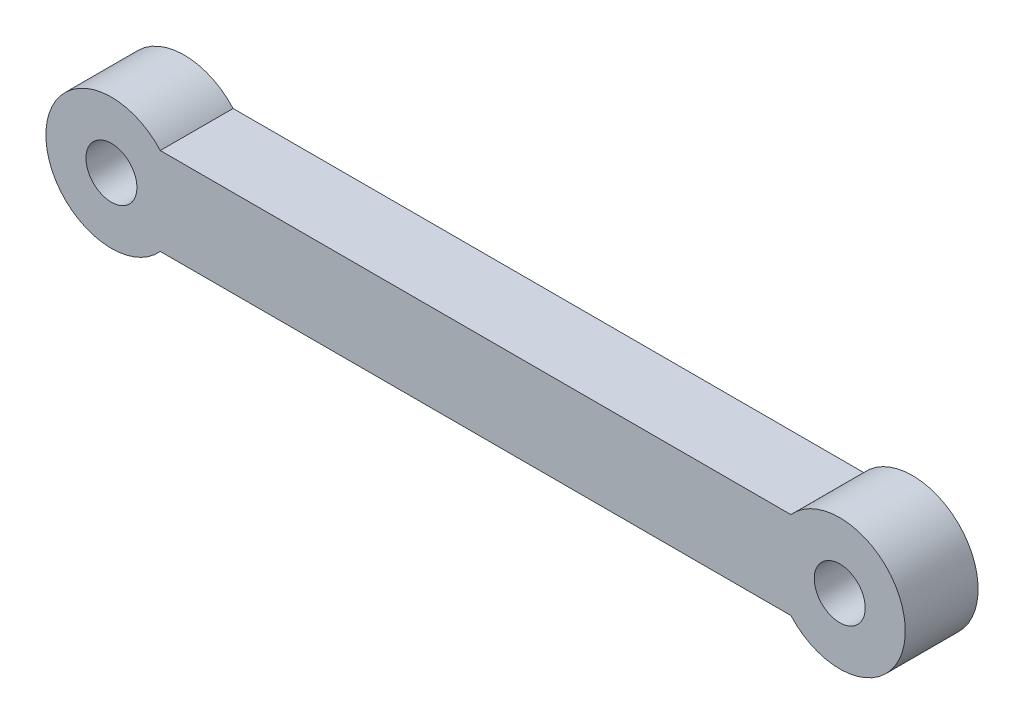
ISO-10303-21;
HEADER;
FILE_DESCRIPTION(('STEP AP214'),'2;1');
FILE_NAME('part.step','',(''),(''),'','','');
FILE_SCHEMA(('AUTOMOTIVE_DESIGN { 1 0 10303 214 1 1 1 1 }'));
ENDSEC;
DATA;
#1=APPLICATION_CONTEXT('core data for automotive mechanical design processes');
#2=APPLICATION_PROTOCOL_DEFINITION('international standard','automotive_design',2000,#1);
#3=PRODUCT_CONTEXT('',#1,'mechanical');
#4=PRODUCT('Part','Part','',(#3));
#5=PRODUCT_RELATED_PRODUCT_CATEGORY('part','',(#4));
#6=PRODUCT_DEFINITION_FORMATION('','',#4);
#7=PRODUCT_DEFINITION_CONTEXT('part definition',#1,'design');
#8=PRODUCT_DEFINITION('design','',#6,#7);
#9=PRODUCT_DEFINITION_SHAPE('','',#8);
#10=(LENGTH_UNIT() NAMED_UNIT(*) SI_UNIT(.MILLI.,.METRE.));
#11=(NAMED_UNIT(*) PLANE_ANGLE_UNIT() SI_UNIT($,.RADIAN.));
#12=(NAMED_UNIT(*) SI_UNIT($,.STERADIAN.) SOLID_ANGLE_UNIT());
#13=UNCERTAINTY_MEASURE_WITH_UNIT(LENGTH_MEASURE(1.E-05),#10,'distance_accuracy_value','');
#14=(GEOMETRIC_REPRESENTATION_CONTEXT(3) GLOBAL_UNCERTAINTY_ASSIGNED_CONTEXT((#13)) GLOBAL_UNIT_ASSIGNED_CONTEXT((#10,
#11,#12)) REPRESENTATION_CONTEXT('',''));
#15=CARTESIAN_POINT('',(0.,0.,0.));
#16=DIRECTION('',(0.,0.,1.));
#17=DIRECTION('',(1.,0.,0.));
#18=AXIS2_PLACEMENT_3D('',#15,#16,#17);
#19=CARTESIAN_POINT('',(-50.,0.,5.));
#20=DIRECTION('',(0.,0.,1.));
#21=DIRECTION('',(1.,0.,0.));
#22=AXIS2_PLACEMENT_3D('',#19,#20,#21);
#23=PLANE('',#22);
#24=CARTESIAN_POINT('',(0.,0.,5.));
#25=DIRECTION('',(0.,0.,1.));
#26=DIRECTION('',(1.,0.,0.));
#27=AXIS2_PLACEMENT_3D('',#24,#25,#26);
#28=CIRCLE('',#27,1.75);
#29=CARTESIAN_POINT('',(1.75,0.,5.));
#30=VERTEX_POINT('',#29);
#31=EDGE_CURVE('E100',#30,#30,#28,.T.);
#32=ORIENTED_EDGE('',*,*,#31,.F.);
#33=EDGE_LOOP('',(#32));
#34=FACE_BOUND('',#33,.T.);
#35=CARTESIAN_POINT('',(-50.,0.,5.));
#36=DIRECTION('',(0.,0.,1.));
#37=DIRECTION('',(1.,0.,0.));
#38=AXIS2_PLACEMENT_3D('',#35,#36,#37);
#39=CIRCLE('',#38,4.50000000000001);
#40=CARTESIAN_POINT('',(-46.6458980337503,3.,5.));
#41=VERTEX_POINT('',#40);
#42=CARTESIAN_POINT('',(-46.6458980337503,-3.,5.));
#43=VERTEX_POINT('',#42);
#44=EDGE_CURVE('E85',#41,#43,#39,.T.);
#45=ORIENTED_EDGE('',*,*,#44,.T.);
#46=DIRECTION('',(1.,0.,0.));
#47=VECTOR('',#46,1.);
#48=CARTESIAN_POINT('',(-3.35410196624968,-3.,5.));
#49=LINE('',#48,#47);
#50=CARTESIAN_POINT('',(-3.35410196624968,-3.,5.));
#51=VERTEX_POINT('',#50);
#52=EDGE_CURVE('E80',#43,#51,#49,.T.);
#53=ORIENTED_EDGE('',*,*,#52,.T.);
#54=CARTESIAN_POINT('',(0.,0.,5.));
#55=DIRECTION('',(0.,0.,1.));
#56=DIRECTION('',(1.,0.,0.));
#57=AXIS2_PLACEMENT_3D('',#54,#55,#56);
#58=CIRCLE('',#57,4.5);
#59=CARTESIAN_POINT('',(-3.35410196624968,3.,5.));
#60=VERTEX_POINT('',#59);
#61=EDGE_CURVE('E83',#51,#60,#58,.T.);
#62=ORIENTED_EDGE('',*,*,#61,.T.);
#63=DIRECTION('',(-1.,0.,0.));
#64=VECTOR('',#63,1.);
#65=CARTESIAN_POINT('',(-3.35410196624968,3.,5.));
#66=LINE('',#65,#64);
#67=EDGE_CURVE('E50',#60,#41,#66,.T.);
#68=ORIENTED_EDGE('',*,*,#67,.T.);
#69=EDGE_LOOP('',(#45,#53,#62,#68));
#70=FACE_BOUND('',#69,.T.);
#71=CARTESIAN_POINT('',(-50.,0.,5.));
#72=DIRECTION('',(0.,0.,1.));
#73=DIRECTION('',(1.,0.,0.));
#74=AXIS2_PLACEMENT_3D('',#71,#72,#73);
#75=CIRCLE('',#74,1.75);
#76=CARTESIAN_POINT('',(-48.25,0.,5.));
#77=VERTEX_POINT('',#76);
#78=EDGE_CURVE('E115',#77,#77,#75,.T.);
#79=ORIENTED_EDGE('',*,*,#78,.F.);
#80=EDGE_LOOP('',(#79));
#81=FACE_BOUND('',#80,.T.);
#82=ADVANCED_FACE('F33',(#34,#70,#81),#23,.T.);
#83=CARTESIAN_POINT('',(-50.,0.,0.));
#84=DIRECTION('',(0.,0.,1.));
#85=DIRECTION('',(1.,0.,0.));
#86=AXIS2_PLACEMENT_3D('',#83,#84,#85);
#87=PLANE('',#86);
#88=CARTESIAN_POINT('',(-50.,0.,0.));
#89=DIRECTION('',(0.,0.,1.));
#90=DIRECTION('',(1.,0.,0.));
#91=AXIS2_PLACEMENT_3D('',#88,#89,#90);
#92=CIRCLE('',#91,4.50000000000001);
#93=CARTESIAN_POINT('',(-46.6458980337503,3.,0.));
#94=VERTEX_POINT('',#93);
#95=CARTESIAN_POINT('',(-46.6458980337503,-3.,0.));
#96=VERTEX_POINT('',#95);
#97=EDGE_CURVE('E97',#94,#96,#92,.T.);
#98=ORIENTED_EDGE('',*,*,#97,.F.);
#99=DIRECTION('',(-1.,0.,0.));
#100=VECTOR('',#99,1.);
#101=CARTESIAN_POINT('',(-3.35410196624968,3.,0.));
#102=LINE('',#101,#100);
#103=CARTESIAN_POINT('',(-3.35410196624968,3.,0.));
#104=VERTEX_POINT('',#103);
#105=EDGE_CURVE('E73',#104,#94,#102,.T.);
#106=ORIENTED_EDGE('',*,*,#105,.F.);
#107=CARTESIAN_POINT('',(0.,0.,0.));
#108=DIRECTION('',(0.,0.,1.));
#109=DIRECTION('',(1.,0.,0.));
#110=AXIS2_PLACEMENT_3D('',#107,#108,#109);
#111=CIRCLE('',#110,4.5);
#112=CARTESIAN_POINT('',(-3.35410196624968,-3.,0.));
#113=VERTEX_POINT('',#112);
#114=EDGE_CURVE('E67',#113,#104,#111,.T.);
#115=ORIENTED_EDGE('',*,*,#114,.F.);
#116=DIRECTION('',(1.,0.,0.));
#117=VECTOR('',#116,1.);
#118=CARTESIAN_POINT('',(-3.35410196624968,-3.,0.));
#119=LINE('',#118,#117);
#120=EDGE_CURVE('E89',#96,#113,#119,.T.);
#121=ORIENTED_EDGE('',*,*,#120,.F.);
#122=EDGE_LOOP('',(#98,#106,#115,#121));
#123=FACE_BOUND('',#122,.T.);
#124=CARTESIAN_POINT('',(0.,0.,0.));
#125=DIRECTION('',(0.,0.,1.));
#126=DIRECTION('',(1.,0.,0.));
#127=AXIS2_PLACEMENT_3D('',#124,#125,#126);
#128=CIRCLE('',#127,1.75);
#129=CARTESIAN_POINT('',(1.75,0.,0.));
#130=VERTEX_POINT('',#129);
#131=EDGE_CURVE('E112',#130,#130,#128,.T.);
#132=ORIENTED_EDGE('',*,*,#131,.T.);
#133=EDGE_LOOP('',(#132));
#134=FACE_BOUND('',#133,.T.);
#135=CARTESIAN_POINT('',(-50.,0.,0.));
#136=DIRECTION('',(0.,0.,1.));
#137=DIRECTION('',(1.,0.,0.));
#138=AXIS2_PLACEMENT_3D('',#135,#136,#137);
#139=CIRCLE('',#138,1.75);
#140=CARTESIAN_POINT('',(-48.25,0.,0.));
#141=VERTEX_POINT('',#140);
#142=EDGE_CURVE('E118',#141,#141,#139,.T.);
#143=ORIENTED_EDGE('',*,*,#142,.T.);
#144=EDGE_LOOP('',(#143));
#145=FACE_BOUND('',#144,.T.);
#146=ADVANCED_FACE('F108',(#123,#134,#145),#87,.F.);
#147=CARTESIAN_POINT('',(-50.,0.,5.));
#148=DIRECTION('',(0.,0.,-1.));
#149=DIRECTION('',(-1.,0.,0.));
#150=AXIS2_PLACEMENT_3D('',#147,#148,#149);
#151=CYLINDRICAL_SURFACE('',#150,4.50000000000001);
#152=ORIENTED_EDGE('',*,*,#97,.T.);
#153=DIRECTION('',(0.,0.,-1.));
#154=VECTOR('',#153,1.);
#155=CARTESIAN_POINT('',(-46.6458980337503,-3.,5.));
#156=LINE('',#155,#154);
#157=EDGE_CURVE('E11',#43,#96,#156,.T.);
#158=ORIENTED_EDGE('',*,*,#157,.F.);
#159=ORIENTED_EDGE('',*,*,#44,.F.);
#160=DIRECTION('',(0.,0.,-1.));
#161=VECTOR('',#160,1.);
#162=CARTESIAN_POINT('',(-46.6458980337503,3.,5.));
#163=LINE('',#162,#161);
#164=EDGE_CURVE('E93',#41,#94,#163,.T.);
#165=ORIENTED_EDGE('',*,*,#164,.T.);
#166=EDGE_LOOP('',(#152,#158,#159,#165));
#167=FACE_BOUND('',#166,.T.);
#168=ADVANCED_FACE('F35',(#167),#151,.T.);
#169=CARTESIAN_POINT('',(-3.35410196624968,-3.,5.));
#170=DIRECTION('',(0.,1.,0.));
#171=DIRECTION('',(-1.,0.,0.));
#172=AXIS2_PLACEMENT_3D('',#169,#170,#171);
#173=PLANE('',#172);
#174=ORIENTED_EDGE('',*,*,#120,.T.);
#175=DIRECTION('',(0.,0.,-1.));
#176=VECTOR('',#175,1.);
#177=CARTESIAN_POINT('',(-3.35410196624968,-3.,5.));
#178=LINE('',#177,#176);
#179=EDGE_CURVE('E42',#51,#113,#178,.T.);
#180=ORIENTED_EDGE('',*,*,#179,.F.);
#181=ORIENTED_EDGE('',*,*,#52,.F.);
#182=ORIENTED_EDGE('',*,*,#157,.T.);
#183=EDGE_LOOP('',(#174,#180,#181,#182));
#184=FACE_BOUND('',#183,.T.);
#185=ADVANCED_FACE('F88',(#184),#173,.F.);
#186=CARTESIAN_POINT('',(0.,0.,5.));
#187=DIRECTION('',(0.,0.,-1.));
#188=DIRECTION('',(-1.,0.,0.));
#189=AXIS2_PLACEMENT_3D('',#186,#187,#188);
#190=CYLINDRICAL_SURFACE('',#189,4.5);
#191=ORIENTED_EDGE('',*,*,#114,.T.);
#192=DIRECTION('',(0.,0.,-1.));
#193=VECTOR('',#192,1.);
#194=CARTESIAN_POINT('',(-3.35410196624968,3.,5.));
#195=LINE('',#194,#193);
#196=EDGE_CURVE('E90',#60,#104,#195,.T.);
#197=ORIENTED_EDGE('',*,*,#196,.F.);
#198=ORIENTED_EDGE('',*,*,#61,.F.);
#199=ORIENTED_EDGE('',*,*,#179,.T.);
#200=EDGE_LOOP('',(#191,#197,#198,#199));
#201=FACE_BOUND('',#200,.T.);
#202=ADVANCED_FACE('F91',(#201),#190,.T.);
#203=CARTESIAN_POINT('',(-3.35410196624968,3.,5.));
#204=DIRECTION('',(0.,-1.,0.));
#205=DIRECTION('',(1.,0.,0.));
#206=AXIS2_PLACEMENT_3D('',#203,#204,#205);
#207=PLANE('',#206);
#208=ORIENTED_EDGE('',*,*,#105,.T.);
#209=ORIENTED_EDGE('',*,*,#164,.F.);
#210=ORIENTED_EDGE('',*,*,#67,.F.);
#211=ORIENTED_EDGE('',*,*,#196,.T.);
#212=EDGE_LOOP('',(#208,#209,#210,#211));
#213=FACE_BOUND('',#212,.T.);
#214=ADVANCED_FACE('F105',(#213),#207,.F.);
#215=CARTESIAN_POINT('',(0.,0.,5.));
#216=DIRECTION('',(0.,0.,-1.));
#217=DIRECTION('',(-1.,0.,0.));
#218=AXIS2_PLACEMENT_3D('',#215,#216,#217);
#219=CYLINDRICAL_SURFACE('',#218,1.75);
#220=ORIENTED_EDGE('',*,*,#31,.T.);
#221=EDGE_LOOP('',(#220));
#222=FACE_BOUND('',#221,.T.);
#223=ORIENTED_EDGE('',*,*,#131,.F.);
#224=EDGE_LOOP('',(#223));
#225=FACE_BOUND('',#224,.T.);
#226=ADVANCED_FACE('F135',(#222,#225),#219,.F.);
#227=CARTESIAN_POINT('',(-50.,0.,5.));
#228=DIRECTION('',(0.,0.,-1.));
#229=DIRECTION('',(-1.,0.,0.));
#230=AXIS2_PLACEMENT_3D('',#227,#228,#229);
#231=CYLINDRICAL_SURFACE('',#230,1.75);
#232=ORIENTED_EDGE('',*,*,#78,.T.);
#233=EDGE_LOOP('',(#232));
#234=FACE_BOUND('',#233,.T.);
#235=ORIENTED_EDGE('',*,*,#142,.F.);
#236=EDGE_LOOP('',(#235));
#237=FACE_BOUND('',#236,.T.);
#238=ADVANCED_FACE('F124',(#234,#237),#231,.F.);
#239=CLOSED_SHELL('',(#82,#146,#168,#185,#202,#214,#226,#238));
#240=MANIFOLD_SOLID_BREP('B2',#239);
#241=ADVANCED_BREP_SHAPE_REPRESENTATION('',(#18,#240),#14);
#242=SHAPE_DEFINITION_REPRESENTATION(#9,#241);
ENDSEC;
END-ISO-10303-21;
